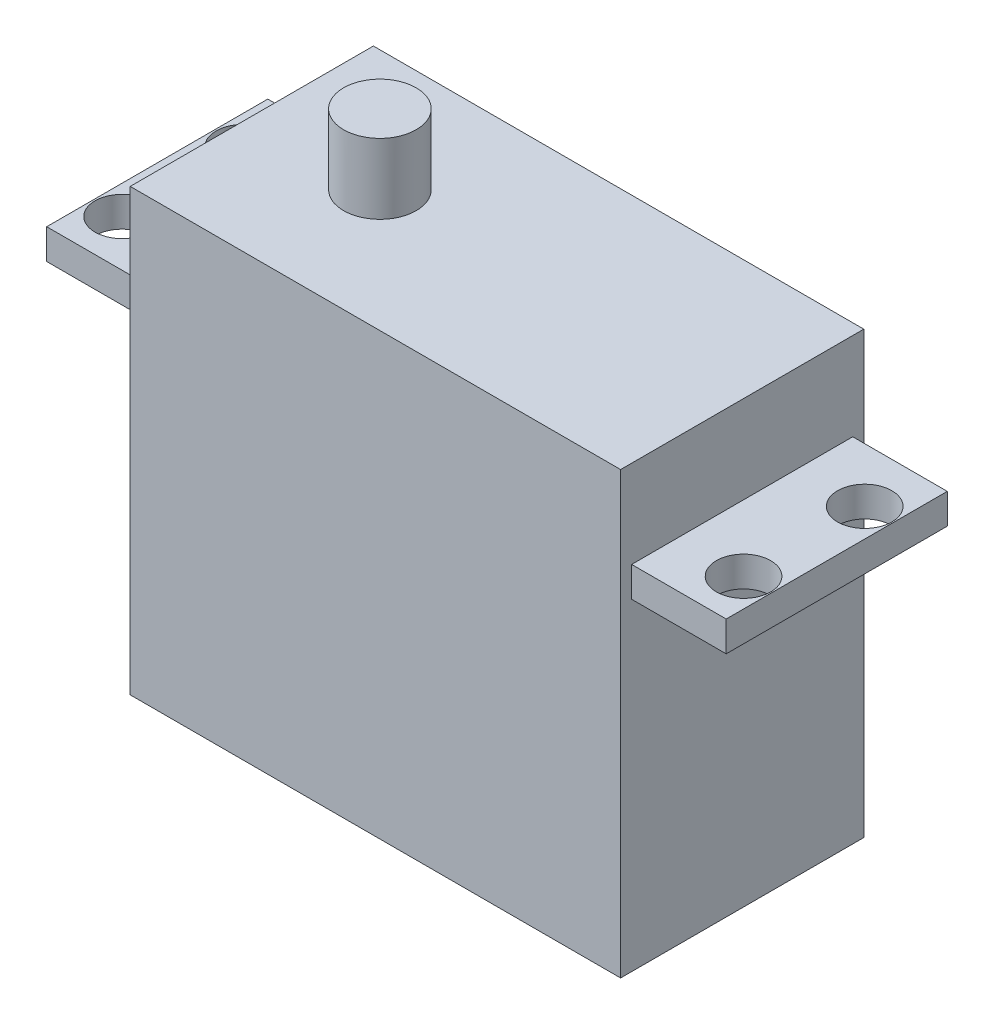
ISO-10303-21;
HEADER;
FILE_DESCRIPTION(('STEP AP214'),'2;1');
FILE_NAME('part.step','',(''),(''),'','','');
FILE_SCHEMA(('AUTOMOTIVE_DESIGN { 1 0 10303 214 1 1 1 1 }'));
ENDSEC;
DATA;
#1=APPLICATION_CONTEXT('core data for automotive mechanical design processes');
#2=APPLICATION_PROTOCOL_DEFINITION('international standard','automotive_design',2000,#1);
#3=PRODUCT_CONTEXT('',#1,'mechanical');
#4=PRODUCT('Part','Part','',(#3));
#5=PRODUCT_RELATED_PRODUCT_CATEGORY('part','',(#4));
#6=PRODUCT_DEFINITION_FORMATION('','',#4);
#7=PRODUCT_DEFINITION_CONTEXT('part definition',#1,'design');
#8=PRODUCT_DEFINITION('design','',#6,#7);
#9=PRODUCT_DEFINITION_SHAPE('','',#8);
#10=(LENGTH_UNIT() NAMED_UNIT(*) SI_UNIT(.MILLI.,.METRE.));
#11=(NAMED_UNIT(*) PLANE_ANGLE_UNIT() SI_UNIT($,.RADIAN.));
#12=(NAMED_UNIT(*) SI_UNIT($,.STERADIAN.) SOLID_ANGLE_UNIT());
#13=UNCERTAINTY_MEASURE_WITH_UNIT(LENGTH_MEASURE(1.E-05),#10,'distance_accuracy_value','');
#14=(GEOMETRIC_REPRESENTATION_CONTEXT(3) GLOBAL_UNCERTAINTY_ASSIGNED_CONTEXT((#13)) GLOBAL_UNIT_ASSIGNED_CONTEXT((#10,
#11,#12)) REPRESENTATION_CONTEXT('',''));
#15=CARTESIAN_POINT('',(0.,0.,0.));
#16=DIRECTION('',(0.,0.,1.));
#17=DIRECTION('',(1.,0.,0.));
#18=AXIS2_PLACEMENT_3D('',#15,#16,#17);
#19=CARTESIAN_POINT('',(0.,0.,19.8628));
#20=DIRECTION('',(0.,-1.,0.));
#21=DIRECTION('',(0.,0.,-1.));
#22=AXIS2_PLACEMENT_3D('',#19,#20,#21);
#23=PLANE('',#22);
#24=DIRECTION('',(-1.,0.,0.));
#25=VECTOR('',#24,1.);
#26=CARTESIAN_POINT('',(0.,0.,19.8628));
#27=LINE('',#26,#25);
#28=CARTESIAN_POINT('',(-7.7216,0.,19.8628));
#29=VERTEX_POINT('',#28);
#30=CARTESIAN_POINT('',(-47.7774,0.,19.8628));
#31=VERTEX_POINT('',#30);
#32=EDGE_CURVE('E186',#29,#31,#27,.T.);
#33=ORIENTED_EDGE('',*,*,#32,.F.);
#34=DIRECTION('',(0.,0.,1.));
#35=VECTOR('',#34,1.);
#36=CARTESIAN_POINT('',(-7.7216,0.,-27.4482817422148));
#37=LINE('',#36,#35);
#38=CARTESIAN_POINT('',(-7.7216,0.,0.));
#39=VERTEX_POINT('',#38);
#40=EDGE_CURVE('E161',#39,#29,#37,.T.);
#41=ORIENTED_EDGE('',*,*,#40,.F.);
#42=DIRECTION('',(-1.,0.,0.));
#43=VECTOR('',#42,1.);
#44=CARTESIAN_POINT('',(0.,0.,0.));
#45=LINE('',#44,#43);
#46=CARTESIAN_POINT('',(-47.7774,0.,0.));
#47=VERTEX_POINT('',#46);
#48=EDGE_CURVE('E185',#39,#47,#45,.T.);
#49=ORIENTED_EDGE('',*,*,#48,.T.);
#50=DIRECTION('',(0.,0.,1.));
#51=VECTOR('',#50,1.);
#52=CARTESIAN_POINT('',(-47.7774,0.,-27.4482817422148));
#53=LINE('',#52,#51);
#54=EDGE_CURVE('E179',#47,#31,#53,.T.);
#55=ORIENTED_EDGE('',*,*,#54,.T.);
#56=EDGE_LOOP('',(#33,#41,#49,#55));
#57=FACE_BOUND('',#56,.T.);
#58=CARTESIAN_POINT('',(-37.34435,0.,9.89965));
#59=DIRECTION('',(0.,-1.,0.));
#60=DIRECTION('',(0.,0.,-1.));
#61=AXIS2_PLACEMENT_3D('',#58,#59,#60);
#62=CIRCLE('',#61,2.96545);
#63=CARTESIAN_POINT('',(-37.34435,0.,6.9342));
#64=VERTEX_POINT('',#63);
#65=EDGE_CURVE('E11',#64,#64,#62,.F.);
#66=ORIENTED_EDGE('',*,*,#65,.F.);
#67=EDGE_LOOP('',(#66));
#68=FACE_BOUND('',#67,.T.);
#69=ADVANCED_FACE('F32',(#57,#68),#23,.F.);
#70=CARTESIAN_POINT('',(0.,0.,19.8628));
#71=DIRECTION('',(-1.,0.,0.));
#72=DIRECTION('',(0.,-1.,0.));
#73=AXIS2_PLACEMENT_3D('',#70,#71,#72);
#74=PLANE('',#73);
#75=DIRECTION('',(0.,1.,0.));
#76=VECTOR('',#75,1.);
#77=CARTESIAN_POINT('',(0.,-7.1628,18.9611));
#78=LINE('',#77,#76);
#79=CARTESIAN_POINT('',(0.,-9.62660000000001,18.9611));
#80=VERTEX_POINT('',#79);
#81=CARTESIAN_POINT('',(0.,-7.1628,18.9611));
#82=VERTEX_POINT('',#81);
#83=EDGE_CURVE('E142',#80,#82,#78,.T.);
#84=ORIENTED_EDGE('',*,*,#83,.F.);
#85=DIRECTION('',(0.,0.,1.));
#86=VECTOR('',#85,1.);
#87=CARTESIAN_POINT('',(0.,-9.62660000000001,-27.4482817422148));
#88=LINE('',#87,#86);
#89=CARTESIAN_POINT('',(0.,-9.62660000000001,0.9017));
#90=VERTEX_POINT('',#89);
#91=EDGE_CURVE('E141',#90,#80,#88,.T.);
#92=ORIENTED_EDGE('',*,*,#91,.F.);
#93=DIRECTION('',(0.,-1.,0.));
#94=VECTOR('',#93,1.);
#95=CARTESIAN_POINT('',(0.,-7.1628,0.9017));
#96=LINE('',#95,#94);
#97=CARTESIAN_POINT('',(0.,-7.1628,0.9017));
#98=VERTEX_POINT('',#97);
#99=EDGE_CURVE('E342',#98,#90,#96,.T.);
#100=ORIENTED_EDGE('',*,*,#99,.F.);
#101=DIRECTION('',(0.,0.,1.));
#102=VECTOR('',#101,1.);
#103=CARTESIAN_POINT('',(0.,-7.1628,-27.4482817422148));
#104=LINE('',#103,#102);
#105=EDGE_CURVE('E157',#98,#82,#104,.T.);
#106=ORIENTED_EDGE('',*,*,#105,.T.);
#107=EDGE_LOOP('',(#84,#92,#100,#106));
#108=FACE_BOUND('',#107,.T.);
#109=ADVANCED_FACE('F34',(#108),#74,.F.);
#110=CARTESIAN_POINT('',(-7.7216,-7.1628,-27.4482817422148));
#111=DIRECTION('',(0.,-1.,0.));
#112=DIRECTION('',(0.,0.,-1.));
#113=AXIS2_PLACEMENT_3D('',#110,#111,#112);
#114=PLANE('',#113);
#115=CARTESIAN_POINT('',(-2.314703143,-7.1628,15.2277515137782));
#116=DIRECTION('',(0.,1.,0.));
#117=DIRECTION('',(0.,0.,1.));
#118=AXIS2_PLACEMENT_3D('',#115,#116,#117);
#119=CIRCLE('',#118,2.21615);
#120=CARTESIAN_POINT('',(-2.314703143,-7.1628,17.4439015137782));
#121=VERTEX_POINT('',#120);
#122=EDGE_CURVE('E277',#121,#121,#119,.T.);
#123=ORIENTED_EDGE('',*,*,#122,.F.);
#124=EDGE_LOOP('',(#123));
#125=FACE_BOUND('',#124,.T.);
#126=CARTESIAN_POINT('',(-2.314703143,-7.1628,5.33445151377824));
#127=DIRECTION('',(0.,1.,0.));
#128=DIRECTION('',(0.,0.,1.));
#129=AXIS2_PLACEMENT_3D('',#126,#127,#128);
#130=CIRCLE('',#129,2.21615);
#131=CARTESIAN_POINT('',(-2.314703143,-7.1628,7.55060151377824));
#132=VERTEX_POINT('',#131);
#133=EDGE_CURVE('E283',#132,#132,#130,.T.);
#134=ORIENTED_EDGE('',*,*,#133,.F.);
#135=EDGE_LOOP('',(#134));
#136=FACE_BOUND('',#135,.T.);
#137=DIRECTION('',(-1.,0.,0.));
#138=VECTOR('',#137,1.);
#139=CARTESIAN_POINT('',(-7.7216,-7.1628,18.9611));
#140=LINE('',#139,#138);
#141=CARTESIAN_POINT('',(-7.7216,-7.1628,18.9611));
#142=VERTEX_POINT('',#141);
#143=EDGE_CURVE('E128',#82,#142,#140,.T.);
#144=ORIENTED_EDGE('',*,*,#143,.F.);
#145=ORIENTED_EDGE('',*,*,#105,.F.);
#146=DIRECTION('',(1.,0.,0.));
#147=VECTOR('',#146,1.);
#148=CARTESIAN_POINT('',(0.,-7.1628,0.9017));
#149=LINE('',#148,#147);
#150=CARTESIAN_POINT('',(-7.7216,-7.1628,0.9017));
#151=VERTEX_POINT('',#150);
#152=EDGE_CURVE('E350',#151,#98,#149,.T.);
#153=ORIENTED_EDGE('',*,*,#152,.F.);
#154=DIRECTION('',(0.,0.,1.));
#155=VECTOR('',#154,1.);
#156=CARTESIAN_POINT('',(-7.7216,-7.1628,-27.4482817422148));
#157=LINE('',#156,#155);
#158=EDGE_CURVE('E160',#151,#142,#157,.T.);
#159=ORIENTED_EDGE('',*,*,#158,.T.);
#160=EDGE_LOOP('',(#144,#145,#153,#159));
#161=FACE_BOUND('',#160,.T.);
#162=ADVANCED_FACE('F228',(#125,#136,#161),#114,.F.);
#163=CARTESIAN_POINT('',(-7.7216,-9.62660000000001,-27.4482817422148));
#164=DIRECTION('',(0.,1.,0.));
#165=DIRECTION('',(0.,0.,1.));
#166=AXIS2_PLACEMENT_3D('',#163,#164,#165);
#167=PLANE('',#166);
#168=CARTESIAN_POINT('',(-2.314703143,-9.62660000000001,15.2277515137782));
#169=DIRECTION('',(0.,1.,0.));
#170=DIRECTION('',(0.,0.,1.));
#171=AXIS2_PLACEMENT_3D('',#168,#169,#170);
#172=CIRCLE('',#171,2.21615);
#173=CARTESIAN_POINT('',(-2.314703143,-9.62660000000001,17.4439015137782));
#174=VERTEX_POINT('',#173);
#175=EDGE_CURVE('E280',#174,#174,#172,.F.);
#176=ORIENTED_EDGE('',*,*,#175,.F.);
#177=EDGE_LOOP('',(#176));
#178=FACE_BOUND('',#177,.T.);
#179=CARTESIAN_POINT('',(-2.314703143,-9.62660000000001,5.33445151377824));
#180=DIRECTION('',(0.,1.,0.));
#181=DIRECTION('',(0.,0.,1.));
#182=AXIS2_PLACEMENT_3D('',#179,#180,#181);
#183=CIRCLE('',#182,2.21615);
#184=CARTESIAN_POINT('',(-2.314703143,-9.62660000000001,7.55060151377824));
#185=VERTEX_POINT('',#184);
#186=EDGE_CURVE('E286',#185,#185,#183,.F.);
#187=ORIENTED_EDGE('',*,*,#186,.F.);
#188=EDGE_LOOP('',(#187));
#189=FACE_BOUND('',#188,.T.);
#190=DIRECTION('',(1.,0.,0.));
#191=VECTOR('',#190,1.);
#192=CARTESIAN_POINT('',(-7.7216,-9.62660000000001,18.9611));
#193=LINE('',#192,#191);
#194=CARTESIAN_POINT('',(-7.7216,-9.62660000000001,18.9611));
#195=VERTEX_POINT('',#194);
#196=EDGE_CURVE('E125',#195,#80,#193,.T.);
#197=ORIENTED_EDGE('',*,*,#196,.F.);
#198=DIRECTION('',(0.,0.,1.));
#199=VECTOR('',#198,1.);
#200=CARTESIAN_POINT('',(-7.7216,-9.62660000000001,-27.4482817422148));
#201=LINE('',#200,#199);
#202=CARTESIAN_POINT('',(-7.7216,-9.62660000000001,0.901699999999991));
#203=VERTEX_POINT('',#202);
#204=EDGE_CURVE('E139',#203,#195,#201,.T.);
#205=ORIENTED_EDGE('',*,*,#204,.F.);
#206=DIRECTION('',(-1.,0.,0.));
#207=VECTOR('',#206,1.);
#208=CARTESIAN_POINT('',(0.,-9.62660000000001,0.9017));
#209=LINE('',#208,#207);
#210=EDGE_CURVE('E47',#90,#203,#209,.T.);
#211=ORIENTED_EDGE('',*,*,#210,.F.);
#212=ORIENTED_EDGE('',*,*,#91,.T.);
#213=EDGE_LOOP('',(#197,#205,#211,#212));
#214=FACE_BOUND('',#213,.T.);
#215=ADVANCED_FACE('F138',(#178,#189,#214),#167,.F.);
#216=CARTESIAN_POINT('',(-55.499,0.,19.8628));
#217=DIRECTION('',(1.,0.,0.));
#218=DIRECTION('',(0.,1.,0.));
#219=AXIS2_PLACEMENT_3D('',#216,#217,#218);
#220=PLANE('',#219);
#221=DIRECTION('',(0.,1.,0.));
#222=VECTOR('',#221,1.);
#223=CARTESIAN_POINT('',(-55.499,-7.1628,0.9017));
#224=LINE('',#223,#222);
#225=CARTESIAN_POINT('',(-55.499,-9.62660000000001,0.9017));
#226=VERTEX_POINT('',#225);
#227=CARTESIAN_POINT('',(-55.499,-7.1628,0.9017));
#228=VERTEX_POINT('',#227);
#229=EDGE_CURVE('E262',#226,#228,#224,.T.);
#230=ORIENTED_EDGE('',*,*,#229,.F.);
#231=DIRECTION('',(0.,0.,1.));
#232=VECTOR('',#231,1.);
#233=CARTESIAN_POINT('',(-55.499,-9.62660000000001,-27.4482817422148));
#234=LINE('',#233,#232);
#235=CARTESIAN_POINT('',(-55.499,-9.62660000000001,18.9611));
#236=VERTEX_POINT('',#235);
#237=EDGE_CURVE('E55',#226,#236,#234,.T.);
#238=ORIENTED_EDGE('',*,*,#237,.T.);
#239=DIRECTION('',(0.,-1.,0.));
#240=VECTOR('',#239,1.);
#241=CARTESIAN_POINT('',(-55.499,-7.1628,18.9611));
#242=LINE('',#241,#240);
#243=CARTESIAN_POINT('',(-55.499,-7.1628,18.9611));
#244=VERTEX_POINT('',#243);
#245=EDGE_CURVE('E261',#244,#236,#242,.T.);
#246=ORIENTED_EDGE('',*,*,#245,.F.);
#247=DIRECTION('',(0.,0.,1.));
#248=VECTOR('',#247,1.);
#249=CARTESIAN_POINT('',(-55.499,-7.1628,-27.4482817422148));
#250=LINE('',#249,#248);
#251=EDGE_CURVE('E182',#228,#244,#250,.T.);
#252=ORIENTED_EDGE('',*,*,#251,.F.);
#253=EDGE_LOOP('',(#230,#238,#246,#252));
#254=FACE_BOUND('',#253,.T.);
#255=ADVANCED_FACE('F231',(#254),#220,.F.);
#256=CARTESIAN_POINT('',(-55.499,-7.1628,-27.4482817422148));
#257=DIRECTION('',(0.,-1.,0.));
#258=DIRECTION('',(0.,0.,-1.));
#259=AXIS2_PLACEMENT_3D('',#256,#257,#258);
#260=PLANE('',#259);
#261=CARTESIAN_POINT('',(-53.14315,-7.1628,15.15745));
#262=DIRECTION('',(0.,1.,0.));
#263=DIRECTION('',(0.,0.,1.));
#264=AXIS2_PLACEMENT_3D('',#261,#262,#263);
#265=CIRCLE('',#264,2.21615);
#266=CARTESIAN_POINT('',(-53.14315,-7.1628,17.3736));
#267=VERTEX_POINT('',#266);
#268=EDGE_CURVE('E248',#267,#267,#265,.T.);
#269=ORIENTED_EDGE('',*,*,#268,.F.);
#270=EDGE_LOOP('',(#269));
#271=FACE_BOUND('',#270,.T.);
#272=CARTESIAN_POINT('',(-53.14315,-7.1628,5.26415));
#273=DIRECTION('',(0.,1.,0.));
#274=DIRECTION('',(0.,0.,1.));
#275=AXIS2_PLACEMENT_3D('',#272,#273,#274);
#276=CIRCLE('',#275,2.21615);
#277=CARTESIAN_POINT('',(-53.14315,-7.1628,7.4803));
#278=VERTEX_POINT('',#277);
#279=EDGE_CURVE('E252',#278,#278,#276,.T.);
#280=ORIENTED_EDGE('',*,*,#279,.F.);
#281=EDGE_LOOP('',(#280));
#282=FACE_BOUND('',#281,.T.);
#283=DIRECTION('',(1.,0.,0.));
#284=VECTOR('',#283,1.);
#285=CARTESIAN_POINT('',(-47.7774,-7.1628,0.9017));
#286=LINE('',#285,#284);
#287=CARTESIAN_POINT('',(-47.7774,-7.1628,0.9017));
#288=VERTEX_POINT('',#287);
#289=EDGE_CURVE('E256',#228,#288,#286,.T.);
#290=ORIENTED_EDGE('',*,*,#289,.F.);
#291=ORIENTED_EDGE('',*,*,#251,.T.);
#292=DIRECTION('',(-1.,0.,0.));
#293=VECTOR('',#292,1.);
#294=CARTESIAN_POINT('',(-55.499,-7.1628,18.9611));
#295=LINE('',#294,#293);
#296=CARTESIAN_POINT('',(-47.7774,-7.1628,18.9611));
#297=VERTEX_POINT('',#296);
#298=EDGE_CURVE('E275',#297,#244,#295,.T.);
#299=ORIENTED_EDGE('',*,*,#298,.F.);
#300=DIRECTION('',(0.,0.,1.));
#301=VECTOR('',#300,1.);
#302=CARTESIAN_POINT('',(-47.7774,-7.1628,-27.4482817422148));
#303=LINE('',#302,#301);
#304=EDGE_CURVE('E175',#288,#297,#303,.T.);
#305=ORIENTED_EDGE('',*,*,#304,.F.);
#306=EDGE_LOOP('',(#290,#291,#299,#305));
#307=FACE_BOUND('',#306,.T.);
#308=ADVANCED_FACE('F234',(#271,#282,#307),#260,.F.);
#309=CARTESIAN_POINT('',(-55.499,-9.62660000000001,-27.4482817422148));
#310=DIRECTION('',(0.,1.,0.));
#311=DIRECTION('',(0.,0.,1.));
#312=AXIS2_PLACEMENT_3D('',#309,#310,#311);
#313=PLANE('',#312);
#314=CARTESIAN_POINT('',(-53.14315,-9.62660000000001,15.15745));
#315=DIRECTION('',(0.,1.,0.));
#316=DIRECTION('',(0.,0.,1.));
#317=AXIS2_PLACEMENT_3D('',#314,#315,#316);
#318=CIRCLE('',#317,2.21615);
#319=CARTESIAN_POINT('',(-53.14315,-9.62660000000001,17.3736));
#320=VERTEX_POINT('',#319);
#321=EDGE_CURVE('E290',#320,#320,#318,.F.);
#322=ORIENTED_EDGE('',*,*,#321,.F.);
#323=EDGE_LOOP('',(#322));
#324=FACE_BOUND('',#323,.T.);
#325=CARTESIAN_POINT('',(-53.14315,-9.62660000000001,5.26415));
#326=DIRECTION('',(0.,1.,0.));
#327=DIRECTION('',(0.,0.,1.));
#328=AXIS2_PLACEMENT_3D('',#325,#326,#327);
#329=CIRCLE('',#328,2.21615);
#330=CARTESIAN_POINT('',(-53.14315,-9.62660000000001,7.4803));
#331=VERTEX_POINT('',#330);
#332=EDGE_CURVE('E151',#331,#331,#329,.F.);
#333=ORIENTED_EDGE('',*,*,#332,.F.);
#334=EDGE_LOOP('',(#333));
#335=FACE_BOUND('',#334,.T.);
#336=DIRECTION('',(-1.,0.,0.));
#337=VECTOR('',#336,1.);
#338=CARTESIAN_POINT('',(-47.7774,-9.62660000000001,0.9017));
#339=LINE('',#338,#337);
#340=CARTESIAN_POINT('',(-47.7774,-9.62660000000001,0.9017));
#341=VERTEX_POINT('',#340);
#342=EDGE_CURVE('E299',#341,#226,#339,.T.);
#343=ORIENTED_EDGE('',*,*,#342,.F.);
#344=DIRECTION('',(0.,0.,1.));
#345=VECTOR('',#344,1.);
#346=CARTESIAN_POINT('',(-47.7774,-9.62660000000001,-27.4482817422148));
#347=LINE('',#346,#345);
#348=CARTESIAN_POINT('',(-47.7774,-9.62660000000001,18.9611));
#349=VERTEX_POINT('',#348);
#350=EDGE_CURVE('E169',#341,#349,#347,.T.);
#351=ORIENTED_EDGE('',*,*,#350,.T.);
#352=DIRECTION('',(1.,0.,0.));
#353=VECTOR('',#352,1.);
#354=CARTESIAN_POINT('',(-55.499,-9.62660000000001,18.9611));
#355=LINE('',#354,#353);
#356=EDGE_CURVE('E267',#236,#349,#355,.T.);
#357=ORIENTED_EDGE('',*,*,#356,.F.);
#358=ORIENTED_EDGE('',*,*,#237,.F.);
#359=EDGE_LOOP('',(#343,#351,#357,#358));
#360=FACE_BOUND('',#359,.T.);
#361=ADVANCED_FACE('F236',(#324,#335,#360),#313,.F.);
#362=CARTESIAN_POINT('',(0.,-35.9664,19.8628));
#363=DIRECTION('',(0.,1.,0.));
#364=DIRECTION('',(-1.,0.,0.));
#365=AXIS2_PLACEMENT_3D('',#362,#363,#364);
#366=PLANE('',#365);
#367=DIRECTION('',(1.,0.,0.));
#368=VECTOR('',#367,1.);
#369=CARTESIAN_POINT('',(0.,-35.9664,0.));
#370=LINE('',#369,#368);
#371=CARTESIAN_POINT('',(-47.7774,-35.9664,0.));
#372=VERTEX_POINT('',#371);
#373=CARTESIAN_POINT('',(-7.7216,-35.9664,0.));
#374=VERTEX_POINT('',#373);
#375=EDGE_CURVE('E188',#372,#374,#370,.T.);
#376=ORIENTED_EDGE('',*,*,#375,.T.);
#377=DIRECTION('',(0.,0.,1.));
#378=VECTOR('',#377,1.);
#379=CARTESIAN_POINT('',(-7.72159999999999,-35.9664,-27.4482817422148));
#380=LINE('',#379,#378);
#381=CARTESIAN_POINT('',(-7.72159999999999,-35.9664,19.8628));
#382=VERTEX_POINT('',#381);
#383=EDGE_CURVE('E146',#374,#382,#380,.T.);
#384=ORIENTED_EDGE('',*,*,#383,.T.);
#385=DIRECTION('',(1.,0.,0.));
#386=VECTOR('',#385,1.);
#387=CARTESIAN_POINT('',(0.,-35.9664,19.8628));
#388=LINE('',#387,#386);
#389=CARTESIAN_POINT('',(-47.7774,-35.9664,19.8628));
#390=VERTEX_POINT('',#389);
#391=EDGE_CURVE('E40',#390,#382,#388,.T.);
#392=ORIENTED_EDGE('',*,*,#391,.F.);
#393=DIRECTION('',(0.,0.,1.));
#394=VECTOR('',#393,1.);
#395=CARTESIAN_POINT('',(-47.7774,-35.9664,-27.4482817422148));
#396=LINE('',#395,#394);
#397=EDGE_CURVE('E166',#372,#390,#396,.T.);
#398=ORIENTED_EDGE('',*,*,#397,.F.);
#399=EDGE_LOOP('',(#376,#384,#392,#398));
#400=FACE_BOUND('',#399,.T.);
#401=ADVANCED_FACE('F195',(#400),#366,.F.);
#402=CARTESIAN_POINT('',(0.,0.,19.8628));
#403=DIRECTION('',(0.,0.,-1.));
#404=DIRECTION('',(-1.,0.,0.));
#405=AXIS2_PLACEMENT_3D('',#402,#403,#404);
#406=PLANE('',#405);
#407=ORIENTED_EDGE('',*,*,#391,.T.);
#408=DIRECTION('',(0.,-1.,0.));
#409=VECTOR('',#408,1.);
#410=CARTESIAN_POINT('',(-7.7216,0.,19.8628));
#411=LINE('',#410,#409);
#412=EDGE_CURVE('E149',#29,#382,#411,.T.);
#413=ORIENTED_EDGE('',*,*,#412,.F.);
#414=ORIENTED_EDGE('',*,*,#32,.T.);
#415=DIRECTION('',(0.,1.,0.));
#416=VECTOR('',#415,1.);
#417=CARTESIAN_POINT('',(-47.7774,0.,19.8628));
#418=LINE('',#417,#416);
#419=EDGE_CURVE('E168',#390,#31,#418,.T.);
#420=ORIENTED_EDGE('',*,*,#419,.F.);
#421=EDGE_LOOP('',(#407,#413,#414,#420));
#422=FACE_BOUND('',#421,.T.);
#423=ADVANCED_FACE('F206',(#422),#406,.F.);
#424=CARTESIAN_POINT('',(0.,0.,0.));
#425=DIRECTION('',(0.,0.,-1.));
#426=DIRECTION('',(-1.,0.,0.));
#427=AXIS2_PLACEMENT_3D('',#424,#425,#426);
#428=PLANE('',#427);
#429=DIRECTION('',(0.,-1.,0.));
#430=VECTOR('',#429,1.);
#431=CARTESIAN_POINT('',(-7.7216,0.,0.));
#432=LINE('',#431,#430);
#433=EDGE_CURVE('E158',#39,#374,#432,.T.);
#434=ORIENTED_EDGE('',*,*,#433,.T.);
#435=ORIENTED_EDGE('',*,*,#375,.F.);
#436=DIRECTION('',(0.,1.,0.));
#437=VECTOR('',#436,1.);
#438=CARTESIAN_POINT('',(-47.7774,0.,0.));
#439=LINE('',#438,#437);
#440=EDGE_CURVE('E176',#372,#47,#439,.T.);
#441=ORIENTED_EDGE('',*,*,#440,.T.);
#442=ORIENTED_EDGE('',*,*,#48,.F.);
#443=EDGE_LOOP('',(#434,#435,#441,#442));
#444=FACE_BOUND('',#443,.T.);
#445=ADVANCED_FACE('F199',(#444),#428,.T.);
#446=CARTESIAN_POINT('',(-47.7774,0.,-27.4482817422148));
#447=DIRECTION('',(1.,0.,0.));
#448=DIRECTION('',(0.,0.,-1.));
#449=AXIS2_PLACEMENT_3D('',#446,#447,#448);
#450=PLANE('',#449);
#451=DIRECTION('',(0.,-1.,0.));
#452=VECTOR('',#451,1.);
#453=CARTESIAN_POINT('',(-47.7774,-7.1628,0.9017));
#454=LINE('',#453,#452);
#455=EDGE_CURVE('E302',#288,#341,#454,.T.);
#456=ORIENTED_EDGE('',*,*,#455,.F.);
#457=ORIENTED_EDGE('',*,*,#304,.T.);
#458=DIRECTION('',(0.,1.,0.));
#459=VECTOR('',#458,1.);
#460=CARTESIAN_POINT('',(-47.7774,-7.1628,18.9611));
#461=LINE('',#460,#459);
#462=EDGE_CURVE('E269',#349,#297,#461,.T.);
#463=ORIENTED_EDGE('',*,*,#462,.F.);
#464=ORIENTED_EDGE('',*,*,#350,.F.);
#465=EDGE_LOOP('',(#456,#457,#463,#464));
#466=FACE_BOUND('',#465,.T.);
#467=ORIENTED_EDGE('',*,*,#440,.F.);
#468=ORIENTED_EDGE('',*,*,#397,.T.);
#469=ORIENTED_EDGE('',*,*,#419,.T.);
#470=ORIENTED_EDGE('',*,*,#54,.F.);
#471=EDGE_LOOP('',(#467,#468,#469,#470));
#472=FACE_BOUND('',#471,.T.);
#473=ADVANCED_FACE('F211',(#466,#472),#450,.F.);
#474=CARTESIAN_POINT('',(-7.7216,0.,-27.4482817422148));
#475=DIRECTION('',(-1.,0.,0.));
#476=DIRECTION('',(0.,0.,1.));
#477=AXIS2_PLACEMENT_3D('',#474,#475,#476);
#478=PLANE('',#477);
#479=ORIENTED_EDGE('',*,*,#412,.T.);
#480=ORIENTED_EDGE('',*,*,#383,.F.);
#481=ORIENTED_EDGE('',*,*,#433,.F.);
#482=ORIENTED_EDGE('',*,*,#40,.T.);
#483=EDGE_LOOP('',(#479,#480,#481,#482));
#484=FACE_BOUND('',#483,.T.);
#485=DIRECTION('',(0.,-1.,0.));
#486=VECTOR('',#485,1.);
#487=CARTESIAN_POINT('',(-7.7216,-7.1628,18.9611));
#488=LINE('',#487,#486);
#489=EDGE_CURVE('E122',#142,#195,#488,.T.);
#490=ORIENTED_EDGE('',*,*,#489,.F.);
#491=ORIENTED_EDGE('',*,*,#158,.F.);
#492=DIRECTION('',(0.,1.,0.));
#493=VECTOR('',#492,1.);
#494=CARTESIAN_POINT('',(-7.7216,-7.1628,0.9017));
#495=LINE('',#494,#493);
#496=EDGE_CURVE('E145',#203,#151,#495,.T.);
#497=ORIENTED_EDGE('',*,*,#496,.F.);
#498=ORIENTED_EDGE('',*,*,#204,.T.);
#499=EDGE_LOOP('',(#490,#491,#497,#498));
#500=FACE_BOUND('',#499,.T.);
#501=ADVANCED_FACE('F144',(#484,#500),#478,.F.);
#502=CARTESIAN_POINT('',(-53.14315,-15.8948187725063,5.26415));
#503=DIRECTION('',(0.,1.,0.));
#504=DIRECTION('',(0.,0.,1.));
#505=AXIS2_PLACEMENT_3D('',#502,#503,#504);
#506=CYLINDRICAL_SURFACE('',#505,2.21615);
#507=ORIENTED_EDGE('',*,*,#332,.T.);
#508=EDGE_LOOP('',(#507));
#509=FACE_BOUND('',#508,.T.);
#510=ORIENTED_EDGE('',*,*,#279,.T.);
#511=EDGE_LOOP('',(#510));
#512=FACE_BOUND('',#511,.T.);
#513=ADVANCED_FACE('F219',(#509,#512),#506,.F.);
#514=CARTESIAN_POINT('',(-53.14315,-15.8948187725063,15.15745));
#515=DIRECTION('',(0.,1.,0.));
#516=DIRECTION('',(0.,0.,1.));
#517=AXIS2_PLACEMENT_3D('',#514,#515,#516);
#518=CYLINDRICAL_SURFACE('',#517,2.21615);
#519=ORIENTED_EDGE('',*,*,#321,.T.);
#520=EDGE_LOOP('',(#519));
#521=FACE_BOUND('',#520,.T.);
#522=ORIENTED_EDGE('',*,*,#268,.T.);
#523=EDGE_LOOP('',(#522));
#524=FACE_BOUND('',#523,.T.);
#525=ADVANCED_FACE('F322',(#521,#524),#518,.F.);
#526=CARTESIAN_POINT('',(-2.314703143,-15.8948187725063,5.33445151377824));
#527=DIRECTION('',(0.,1.,0.));
#528=DIRECTION('',(0.,0.,1.));
#529=AXIS2_PLACEMENT_3D('',#526,#527,#528);
#530=CYLINDRICAL_SURFACE('',#529,2.21615);
#531=ORIENTED_EDGE('',*,*,#186,.T.);
#532=EDGE_LOOP('',(#531));
#533=FACE_BOUND('',#532,.T.);
#534=ORIENTED_EDGE('',*,*,#133,.T.);
#535=EDGE_LOOP('',(#534));
#536=FACE_BOUND('',#535,.T.);
#537=ADVANCED_FACE('F315',(#533,#536),#530,.F.);
#538=CARTESIAN_POINT('',(-2.314703143,-15.8948187725063,15.2277515137782));
#539=DIRECTION('',(0.,1.,0.));
#540=DIRECTION('',(0.,0.,1.));
#541=AXIS2_PLACEMENT_3D('',#538,#539,#540);
#542=CYLINDRICAL_SURFACE('',#541,2.21615);
#543=ORIENTED_EDGE('',*,*,#175,.T.);
#544=EDGE_LOOP('',(#543));
#545=FACE_BOUND('',#544,.T.);
#546=ORIENTED_EDGE('',*,*,#122,.T.);
#547=EDGE_LOOP('',(#546));
#548=FACE_BOUND('',#547,.T.);
#549=ADVANCED_FACE('F307',(#545,#548),#542,.F.);
#550=CARTESIAN_POINT('',(0.,0.,18.9611));
#551=DIRECTION('',(0.,0.,1.));
#552=DIRECTION('',(1.,0.,0.));
#553=AXIS2_PLACEMENT_3D('',#550,#551,#552);
#554=PLANE('',#553);
#555=ORIENTED_EDGE('',*,*,#245,.T.);
#556=ORIENTED_EDGE('',*,*,#356,.T.);
#557=ORIENTED_EDGE('',*,*,#462,.T.);
#558=ORIENTED_EDGE('',*,*,#298,.T.);
#559=EDGE_LOOP('',(#555,#556,#557,#558));
#560=FACE_BOUND('',#559,.T.);
#561=ADVANCED_FACE('F304',(#560),#554,.T.);
#562=CARTESIAN_POINT('',(0.,0.,0.9017));
#563=DIRECTION('',(0.,0.,-1.));
#564=DIRECTION('',(-1.,0.,0.));
#565=AXIS2_PLACEMENT_3D('',#562,#563,#564);
#566=PLANE('',#565);
#567=ORIENTED_EDGE('',*,*,#455,.T.);
#568=ORIENTED_EDGE('',*,*,#342,.T.);
#569=ORIENTED_EDGE('',*,*,#229,.T.);
#570=ORIENTED_EDGE('',*,*,#289,.T.);
#571=EDGE_LOOP('',(#567,#568,#569,#570));
#572=FACE_BOUND('',#571,.T.);
#573=ADVANCED_FACE('F306',(#572),#566,.T.);
#574=CARTESIAN_POINT('',(0.,0.,0.9017));
#575=DIRECTION('',(0.,0.,-1.));
#576=DIRECTION('',(-1.,0.,0.));
#577=AXIS2_PLACEMENT_3D('',#574,#575,#576);
#578=PLANE('',#577);
#579=ORIENTED_EDGE('',*,*,#99,.T.);
#580=ORIENTED_EDGE('',*,*,#210,.T.);
#581=ORIENTED_EDGE('',*,*,#496,.T.);
#582=ORIENTED_EDGE('',*,*,#152,.T.);
#583=EDGE_LOOP('',(#579,#580,#581,#582));
#584=FACE_BOUND('',#583,.T.);
#585=ADVANCED_FACE('F313',(#584),#578,.T.);
#586=CARTESIAN_POINT('',(0.,0.,18.9611));
#587=DIRECTION('',(0.,0.,1.));
#588=DIRECTION('',(1.,0.,0.));
#589=AXIS2_PLACEMENT_3D('',#586,#587,#588);
#590=PLANE('',#589);
#591=ORIENTED_EDGE('',*,*,#489,.T.);
#592=ORIENTED_EDGE('',*,*,#196,.T.);
#593=ORIENTED_EDGE('',*,*,#83,.T.);
#594=ORIENTED_EDGE('',*,*,#143,.T.);
#595=EDGE_LOOP('',(#591,#592,#593,#594));
#596=FACE_BOUND('',#595,.T.);
#597=ADVANCED_FACE('F124',(#596),#590,.T.);
#598=CARTESIAN_POINT('',(-37.34435,5.7277,9.89965));
#599=DIRECTION('',(0.,-1.,0.));
#600=DIRECTION('',(0.,0.,-1.));
#601=AXIS2_PLACEMENT_3D('',#598,#599,#600);
#602=CYLINDRICAL_SURFACE('',#601,2.96545);
#603=CARTESIAN_POINT('',(-37.34435,5.7277,9.89965));
#604=DIRECTION('',(0.,1.,0.));
#605=DIRECTION('',(0.,0.,1.));
#606=AXIS2_PLACEMENT_3D('',#603,#604,#605);
#607=CIRCLE('',#606,2.96545);
#608=CARTESIAN_POINT('',(-37.34435,5.7277,12.8651));
#609=VERTEX_POINT('',#608);
#610=EDGE_CURVE('E133',#609,#609,#607,.T.);
#611=ORIENTED_EDGE('',*,*,#610,.F.);
#612=EDGE_LOOP('',(#611));
#613=FACE_BOUND('',#612,.T.);
#614=ORIENTED_EDGE('',*,*,#65,.T.);
#615=EDGE_LOOP('',(#614));
#616=FACE_BOUND('',#615,.T.);
#617=ADVANCED_FACE('F356',(#613,#616),#602,.T.);
#618=CARTESIAN_POINT('',(-37.34435,5.7277,9.89965));
#619=DIRECTION('',(0.,1.,0.));
#620=DIRECTION('',(0.,0.,1.));
#621=AXIS2_PLACEMENT_3D('',#618,#619,#620);
#622=PLANE('',#621);
#623=ORIENTED_EDGE('',*,*,#610,.T.);
#624=EDGE_LOOP('',(#623));
#625=FACE_BOUND('',#624,.T.);
#626=ADVANCED_FACE('F361',(#625),#622,.T.);
#627=CLOSED_SHELL('',(#69,#109,#162,#215,#255,#308,#361,#401,#423,#445,#473,#501,#513,#525,#537,
#549,#561,#573,#585,#597,#617,#626));
#628=MANIFOLD_SOLID_BREP('B2',#627);
#629=ADVANCED_BREP_SHAPE_REPRESENTATION('',(#18,#628),#14);
#630=SHAPE_DEFINITION_REPRESENTATION(#9,#629);
ENDSEC;
END-ISO-10303-21;
